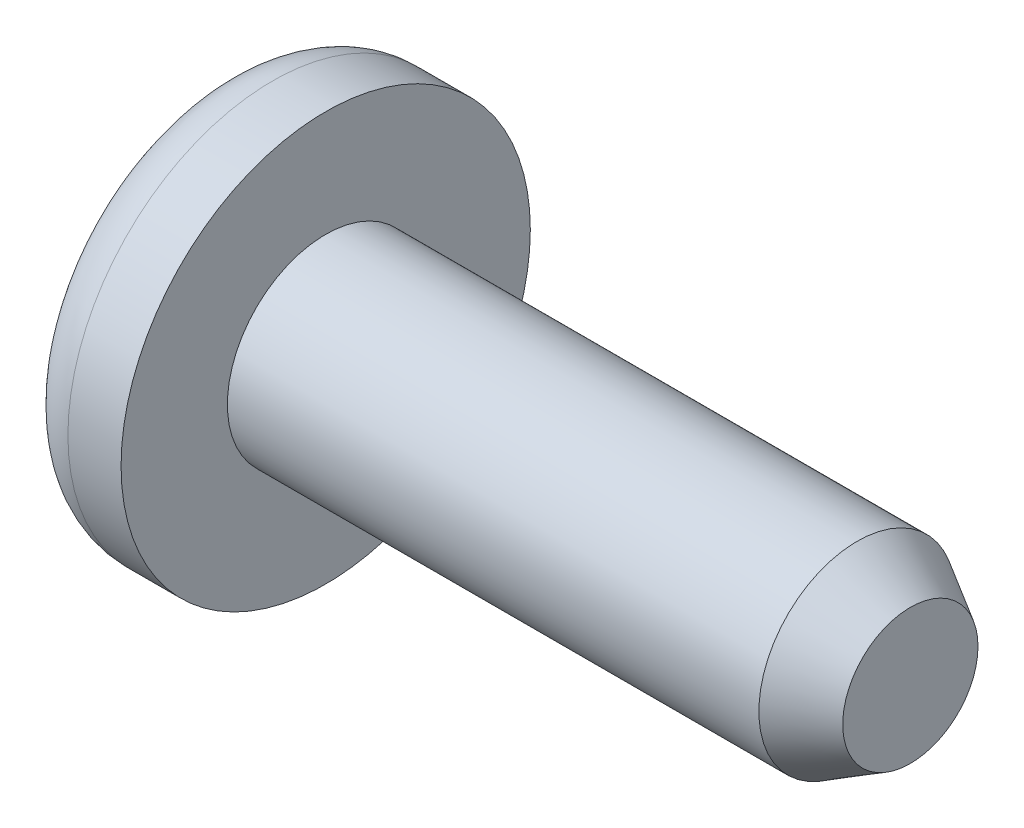
ISO-10303-21;
HEADER;
FILE_DESCRIPTION(('STEP AP214'),'2;1');
FILE_NAME('part.step','',(''),(''),'','','');
FILE_SCHEMA(('AUTOMOTIVE_DESIGN { 1 0 10303 214 1 1 1 1 }'));
ENDSEC;
DATA;
#1=APPLICATION_CONTEXT('core data for automotive mechanical design processes');
#2=APPLICATION_PROTOCOL_DEFINITION('international standard','automotive_design',2000,#1);
#3=PRODUCT_CONTEXT('',#1,'mechanical');
#4=PRODUCT('Part','Part','',(#3));
#5=PRODUCT_RELATED_PRODUCT_CATEGORY('part','',(#4));
#6=PRODUCT_DEFINITION_FORMATION('','',#4);
#7=PRODUCT_DEFINITION_CONTEXT('part definition',#1,'design');
#8=PRODUCT_DEFINITION('design','',#6,#7);
#9=PRODUCT_DEFINITION_SHAPE('','',#8);
#10=(LENGTH_UNIT() NAMED_UNIT(*) SI_UNIT(.MILLI.,.METRE.));
#11=(NAMED_UNIT(*) PLANE_ANGLE_UNIT() SI_UNIT($,.RADIAN.));
#12=(NAMED_UNIT(*) SI_UNIT($,.STERADIAN.) SOLID_ANGLE_UNIT());
#13=UNCERTAINTY_MEASURE_WITH_UNIT(LENGTH_MEASURE(1.E-05),#10,'distance_accuracy_value','');
#14=(GEOMETRIC_REPRESENTATION_CONTEXT(3) GLOBAL_UNCERTAINTY_ASSIGNED_CONTEXT((#13)) GLOBAL_UNIT_ASSIGNED_CONTEXT((#10,
#11,#12)) REPRESENTATION_CONTEXT('',''));
#15=CARTESIAN_POINT('',(0.,0.,0.));
#16=DIRECTION('',(0.,0.,1.));
#17=DIRECTION('',(1.,0.,0.));
#18=AXIS2_PLACEMENT_3D('',#15,#16,#17);
#19=CARTESIAN_POINT('',(6.985,0.,0.));
#20=DIRECTION('',(-1.,0.,0.));
#21=DIRECTION('',(0.,0.,1.));
#22=AXIS2_PLACEMENT_3D('',#19,#20,#21);
#23=CYLINDRICAL_SURFACE('',#22,2.3495);
#24=CARTESIAN_POINT('',(5.71499999999999,0.,0.));
#25=DIRECTION('',(1.,0.,0.));
#26=DIRECTION('',(0.,0.,-1.));
#27=AXIS2_PLACEMENT_3D('',#24,#25,#26);
#28=CIRCLE('',#27,2.3495);
#29=CARTESIAN_POINT('',(5.71499999999999,0.,-2.3495));
#30=VERTEX_POINT('',#29);
#31=EDGE_CURVE('E10',#30,#30,#28,.F.);
#32=ORIENTED_EDGE('',*,*,#31,.T.);
#33=EDGE_LOOP('',(#32));
#34=FACE_BOUND('',#33,.T.);
#35=CARTESIAN_POINT('',(-6.985,0.,0.));
#36=DIRECTION('',(1.,0.,0.));
#37=DIRECTION('',(0.,0.,-1.));
#38=AXIS2_PLACEMENT_3D('',#35,#36,#37);
#39=CIRCLE('',#38,2.3495);
#40=CARTESIAN_POINT('',(-6.985,0.,-2.3495));
#41=VERTEX_POINT('',#40);
#42=EDGE_CURVE('E43',#41,#41,#39,.T.);
#43=ORIENTED_EDGE('',*,*,#42,.T.);
#44=EDGE_LOOP('',(#43));
#45=FACE_BOUND('',#44,.T.);
#46=ADVANCED_FACE('F32',(#34,#45),#23,.T.);
#47=CARTESIAN_POINT('',(6.985,0.,0.));
#48=DIRECTION('',(1.,0.,0.));
#49=DIRECTION('',(0.,0.,-1.));
#50=AXIS2_PLACEMENT_3D('',#47,#48,#49);
#51=PLANE('',#50);
#52=CARTESIAN_POINT('',(6.985,0.,0.));
#53=DIRECTION('',(1.,0.,0.));
#54=DIRECTION('',(0.,0.,-1.));
#55=AXIS2_PLACEMENT_3D('',#52,#53,#54);
#56=CIRCLE('',#55,1.61626515812918);
#57=CARTESIAN_POINT('',(6.985,0.,-1.61626515812918));
#58=VERTEX_POINT('',#57);
#59=EDGE_CURVE('E39',#58,#58,#56,.T.);
#60=ORIENTED_EDGE('',*,*,#59,.T.);
#61=EDGE_LOOP('',(#60));
#62=FACE_BOUND('',#61,.T.);
#63=ADVANCED_FACE('F75',(#62),#51,.T.);
#64=CARTESIAN_POINT('',(-9.525,0.,0.));
#65=DIRECTION('',(-1.,0.,0.));
#66=DIRECTION('',(0.,0.,1.));
#67=AXIS2_PLACEMENT_3D('',#64,#65,#66);
#68=PLANE('',#67);
#69=CARTESIAN_POINT('',(-9.525,0.,0.));
#70=DIRECTION('',(-1.,0.,0.));
#71=DIRECTION('',(0.,0.,1.));
#72=AXIS2_PLACEMENT_3D('',#69,#70,#71);
#73=CIRCLE('',#72,3.61949999999999);
#74=CARTESIAN_POINT('',(-9.525,0.,3.61949999999999));
#75=VERTEX_POINT('',#74);
#76=EDGE_CURVE('E47',#75,#75,#73,.T.);
#77=ORIENTED_EDGE('',*,*,#76,.T.);
#78=EDGE_LOOP('',(#77));
#79=FACE_BOUND('',#78,.T.);
#80=ADVANCED_FACE('F79',(#79),#68,.T.);
#81=CARTESIAN_POINT('',(-8.255,0.,0.));
#82=DIRECTION('',(-1.,0.,0.));
#83=DIRECTION('',(0.,0.,1.));
#84=AXIS2_PLACEMENT_3D('',#81,#82,#83);
#85=TOROIDAL_SURFACE('',#84,3.6195,1.27);
#86=CARTESIAN_POINT('',(-8.25499999999999,0.,0.));
#87=DIRECTION('',(-1.,0.,0.));
#88=DIRECTION('',(0.,0.,1.));
#89=AXIS2_PLACEMENT_3D('',#86,#87,#88);
#90=CIRCLE('',#89,4.8895);
#91=CARTESIAN_POINT('',(-8.25499999999999,0.,4.8895));
#92=VERTEX_POINT('',#91);
#93=EDGE_CURVE('E52',#92,#92,#90,.T.);
#94=ORIENTED_EDGE('',*,*,#93,.T.);
#95=EDGE_LOOP('',(#94));
#96=FACE_BOUND('',#95,.T.);
#97=ORIENTED_EDGE('',*,*,#76,.F.);
#98=EDGE_LOOP('',(#97));
#99=FACE_BOUND('',#98,.T.);
#100=ADVANCED_FACE('F71',(#96,#99),#85,.T.);
#101=CARTESIAN_POINT('',(-9.525,0.,0.));
#102=DIRECTION('',(-1.,0.,0.));
#103=DIRECTION('',(0.,0.,1.));
#104=AXIS2_PLACEMENT_3D('',#101,#102,#103);
#105=CYLINDRICAL_SURFACE('',#104,4.8895);
#106=CARTESIAN_POINT('',(-6.985,0.,0.));
#107=DIRECTION('',(-1.,0.,0.));
#108=DIRECTION('',(0.,0.,1.));
#109=AXIS2_PLACEMENT_3D('',#106,#107,#108);
#110=CIRCLE('',#109,4.8895);
#111=CARTESIAN_POINT('',(-6.985,0.,4.8895));
#112=VERTEX_POINT('',#111);
#113=EDGE_CURVE('E55',#112,#112,#110,.T.);
#114=ORIENTED_EDGE('',*,*,#113,.T.);
#115=EDGE_LOOP('',(#114));
#116=FACE_BOUND('',#115,.T.);
#117=ORIENTED_EDGE('',*,*,#93,.F.);
#118=EDGE_LOOP('',(#117));
#119=FACE_BOUND('',#118,.T.);
#120=ADVANCED_FACE('F59',(#116,#119),#105,.T.);
#121=CARTESIAN_POINT('',(-6.985,0.,0.));
#122=DIRECTION('',(1.,0.,0.));
#123=DIRECTION('',(0.,0.,-1.));
#124=AXIS2_PLACEMENT_3D('',#121,#122,#123);
#125=PLANE('',#124);
#126=ORIENTED_EDGE('',*,*,#42,.F.);
#127=EDGE_LOOP('',(#126));
#128=FACE_BOUND('',#127,.T.);
#129=ORIENTED_EDGE('',*,*,#113,.F.);
#130=EDGE_LOOP('',(#129));
#131=FACE_BOUND('',#130,.T.);
#132=ADVANCED_FACE('F62',(#128,#131),#125,.T.);
#133=CARTESIAN_POINT('',(6.985,0.,0.));
#134=DIRECTION('',(-1.,0.,0.));
#135=DIRECTION('',(0.,0.,1.));
#136=AXIS2_PLACEMENT_3D('',#133,#134,#135);
#137=CONICAL_SURFACE('',#136,1.61626515812918,0.523598775598296);
#138=ORIENTED_EDGE('',*,*,#31,.F.);
#139=EDGE_LOOP('',(#138));
#140=FACE_BOUND('',#139,.T.);
#141=ORIENTED_EDGE('',*,*,#59,.F.);
#142=EDGE_LOOP('',(#141));
#143=FACE_BOUND('',#142,.T.);
#144=ADVANCED_FACE('F34',(#140,#143),#137,.T.);
#145=CLOSED_SHELL('',(#46,#63,#80,#100,#120,#132,#144));
#146=MANIFOLD_SOLID_BREP('B2',#145);
#147=ADVANCED_BREP_SHAPE_REPRESENTATION('',(#18,#146),#14);
#148=SHAPE_DEFINITION_REPRESENTATION(#9,#147);
ENDSEC;
END-ISO-10303-21;
